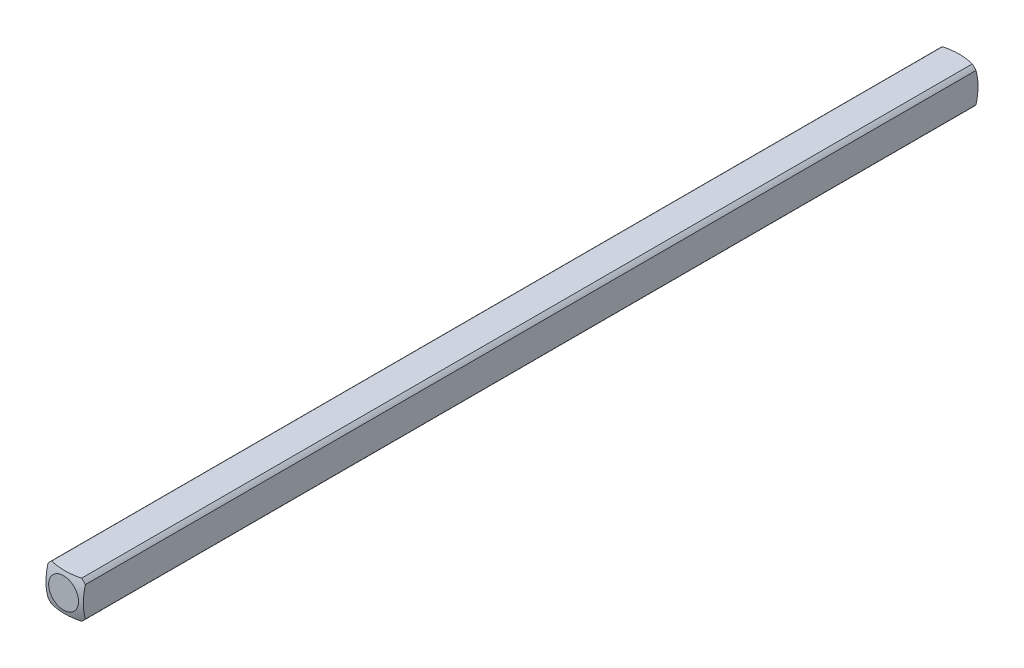
ISO-10303-21;
HEADER;
FILE_DESCRIPTION(('STEP AP214'),'2;1');
FILE_NAME('part.step','',(''),(''),'','','');
FILE_SCHEMA(('AUTOMOTIVE_DESIGN { 1 0 10303 214 1 1 1 1 }'));
ENDSEC;
DATA;
#1=APPLICATION_CONTEXT('core data for automotive mechanical design processes');
#2=APPLICATION_PROTOCOL_DEFINITION('international standard','automotive_design',2000,#1);
#3=PRODUCT_CONTEXT('',#1,'mechanical');
#4=PRODUCT('Part','Part','',(#3));
#5=PRODUCT_RELATED_PRODUCT_CATEGORY('part','',(#4));
#6=PRODUCT_DEFINITION_FORMATION('','',#4);
#7=PRODUCT_DEFINITION_CONTEXT('part definition',#1,'design');
#8=PRODUCT_DEFINITION('design','',#6,#7);
#9=PRODUCT_DEFINITION_SHAPE('','',#8);
#10=(LENGTH_UNIT() NAMED_UNIT(*) SI_UNIT(.MILLI.,.METRE.));
#11=(NAMED_UNIT(*) PLANE_ANGLE_UNIT() SI_UNIT($,.RADIAN.));
#12=(NAMED_UNIT(*) SI_UNIT($,.STERADIAN.) SOLID_ANGLE_UNIT());
#13=UNCERTAINTY_MEASURE_WITH_UNIT(LENGTH_MEASURE(1.E-05),#10,'distance_accuracy_value','');
#14=(GEOMETRIC_REPRESENTATION_CONTEXT(3) GLOBAL_UNCERTAINTY_ASSIGNED_CONTEXT((#13)) GLOBAL_UNIT_ASSIGNED_CONTEXT((#10,
#11,#12)) REPRESENTATION_CONTEXT('',''));
#15=CARTESIAN_POINT('',(0.,0.,0.));
#16=DIRECTION('',(0.,0.,1.));
#17=DIRECTION('',(1.,0.,0.));
#18=AXIS2_PLACEMENT_3D('',#15,#16,#17);
#19=CARTESIAN_POINT('',(-1.5875,-1.5875,38.1));
#20=DIRECTION('',(1.,0.,0.));
#21=DIRECTION('',(0.,0.,-1.));
#22=AXIS2_PLACEMENT_3D('',#19,#20,#21);
#23=PLANE('',#22);
#24=CARTESIAN_POINT('',(-1.5875,0.,4.91912226376204));
#25=DIRECTION('',(1.,0.,0.));
#26=DIRECTION('',(0.,0.,-1.));
#27=AXIS2_PLACEMENT_3D('',#24,#25,#26);
#28=CIRCLE('',#27,4.82558221875869);
#29=CARTESIAN_POINT('',(-1.5875,-1.26841150657032,0.263225357686905));
#30=VERTEX_POINT('',#29);
#31=CARTESIAN_POINT('',(-1.5875,1.26841150657032,0.263225357686935));
#32=VERTEX_POINT('',#31);
#33=EDGE_CURVE('E47',#30,#32,#28,.T.);
#34=ORIENTED_EDGE('',*,*,#33,.F.);
#35=DIRECTION('',(0.,0.,-1.));
#36=VECTOR('',#35,1.);
#37=CARTESIAN_POINT('',(-1.5875,-1.26841150657032,38.1));
#38=LINE('',#37,#36);
#39=CARTESIAN_POINT('',(-1.5875,-1.26841150657032,75.9367746423131));
#40=VERTEX_POINT('',#39);
#41=EDGE_CURVE('E40',#40,#30,#38,.T.);
#42=ORIENTED_EDGE('',*,*,#41,.F.);
#43=CARTESIAN_POINT('',(-1.5875,0.,71.280877736238));
#44=DIRECTION('',(-1.,0.,0.));
#45=DIRECTION('',(0.,0.,1.));
#46=AXIS2_PLACEMENT_3D('',#43,#44,#45);
#47=CIRCLE('',#46,4.82558221875869);
#48=CARTESIAN_POINT('',(-1.5875,1.26841150657032,75.9367746423131));
#49=VERTEX_POINT('',#48);
#50=EDGE_CURVE('E123',#40,#49,#47,.T.);
#51=ORIENTED_EDGE('',*,*,#50,.T.);
#52=DIRECTION('',(0.,0.,-1.));
#53=VECTOR('',#52,1.);
#54=CARTESIAN_POINT('',(-1.5875,1.26841150657032,38.1));
#55=LINE('',#54,#53);
#56=EDGE_CURVE('E111',#32,#49,#55,.F.);
#57=ORIENTED_EDGE('',*,*,#56,.F.);
#58=EDGE_LOOP('',(#34,#42,#51,#57));
#59=FACE_BOUND('',#58,.T.);
#60=ADVANCED_FACE('F33',(#59),#23,.F.);
#61=CARTESIAN_POINT('',(-1.5875,-1.5875,38.1));
#62=DIRECTION('',(0.,1.,0.));
#63=DIRECTION('',(0.,0.,1.));
#64=AXIS2_PLACEMENT_3D('',#61,#62,#63);
#65=PLANE('',#64);
#66=CARTESIAN_POINT('',(0.,-1.5875,4.91912226376204));
#67=DIRECTION('',(0.,1.,0.));
#68=DIRECTION('',(0.,0.,1.));
#69=AXIS2_PLACEMENT_3D('',#66,#67,#68);
#70=CIRCLE('',#69,4.82558221875869);
#71=CARTESIAN_POINT('',(1.26841150657032,-1.5875,0.263225357686905));
#72=VERTEX_POINT('',#71);
#73=CARTESIAN_POINT('',(-1.26841150657032,-1.5875,0.263225357686919));
#74=VERTEX_POINT('',#73);
#75=EDGE_CURVE('E152',#72,#74,#70,.T.);
#76=ORIENTED_EDGE('',*,*,#75,.F.);
#77=DIRECTION('',(0.,0.,-1.));
#78=VECTOR('',#77,1.);
#79=CARTESIAN_POINT('',(1.26841150657032,-1.5875,38.1));
#80=LINE('',#79,#78);
#81=CARTESIAN_POINT('',(1.26841150657032,-1.5875,75.9367746423131));
#82=VERTEX_POINT('',#81);
#83=EDGE_CURVE('E165',#82,#72,#80,.T.);
#84=ORIENTED_EDGE('',*,*,#83,.F.);
#85=CARTESIAN_POINT('',(0.,-1.5875,71.280877736238));
#86=DIRECTION('',(0.,-1.,0.));
#87=DIRECTION('',(0.,0.,-1.));
#88=AXIS2_PLACEMENT_3D('',#85,#86,#87);
#89=CIRCLE('',#88,4.82558221875869);
#90=CARTESIAN_POINT('',(-1.26841150657032,-1.5875,75.9367746423131));
#91=VERTEX_POINT('',#90);
#92=EDGE_CURVE('E134',#82,#91,#89,.T.);
#93=ORIENTED_EDGE('',*,*,#92,.T.);
#94=DIRECTION('',(0.,0.,-1.));
#95=VECTOR('',#94,1.);
#96=CARTESIAN_POINT('',(-1.26841150657032,-1.5875,38.1));
#97=LINE('',#96,#95);
#98=EDGE_CURVE('E163',#74,#91,#97,.F.);
#99=ORIENTED_EDGE('',*,*,#98,.F.);
#100=EDGE_LOOP('',(#76,#84,#93,#99));
#101=FACE_BOUND('',#100,.T.);
#102=ADVANCED_FACE('F175',(#101),#65,.F.);
#103=CARTESIAN_POINT('',(1.5875,-1.5875,38.1));
#104=DIRECTION('',(-1.,0.,0.));
#105=DIRECTION('',(0.,0.,1.));
#106=AXIS2_PLACEMENT_3D('',#103,#104,#105);
#107=PLANE('',#106);
#108=CARTESIAN_POINT('',(1.5875,0.,4.91912226376204));
#109=DIRECTION('',(-1.,0.,0.));
#110=DIRECTION('',(0.,0.,1.));
#111=AXIS2_PLACEMENT_3D('',#108,#109,#110);
#112=CIRCLE('',#111,4.82558221875869);
#113=CARTESIAN_POINT('',(1.5875,1.26841150657032,0.263225357686919));
#114=VERTEX_POINT('',#113);
#115=CARTESIAN_POINT('',(1.5875,-1.26841150657032,0.263225357686905));
#116=VERTEX_POINT('',#115);
#117=EDGE_CURVE('E150',#114,#116,#112,.T.);
#118=ORIENTED_EDGE('',*,*,#117,.F.);
#119=DIRECTION('',(0.,0.,-1.));
#120=VECTOR('',#119,1.);
#121=CARTESIAN_POINT('',(1.5875,1.26841150657032,38.1));
#122=LINE('',#121,#120);
#123=CARTESIAN_POINT('',(1.5875,1.26841150657032,75.9367746423131));
#124=VERTEX_POINT('',#123);
#125=EDGE_CURVE('E160',#124,#114,#122,.T.);
#126=ORIENTED_EDGE('',*,*,#125,.F.);
#127=CARTESIAN_POINT('',(1.5875,0.,71.280877736238));
#128=DIRECTION('',(1.,0.,0.));
#129=DIRECTION('',(0.,0.,-1.));
#130=AXIS2_PLACEMENT_3D('',#127,#128,#129);
#131=CIRCLE('',#130,4.82558221875869);
#132=CARTESIAN_POINT('',(1.5875,-1.26841150657032,75.9367746423131));
#133=VERTEX_POINT('',#132);
#134=EDGE_CURVE('E131',#124,#133,#131,.T.);
#135=ORIENTED_EDGE('',*,*,#134,.T.);
#136=DIRECTION('',(0.,0.,-1.));
#137=VECTOR('',#136,1.);
#138=CARTESIAN_POINT('',(1.5875,-1.26841150657032,38.1));
#139=LINE('',#138,#137);
#140=EDGE_CURVE('E104',#116,#133,#139,.F.);
#141=ORIENTED_EDGE('',*,*,#140,.F.);
#142=EDGE_LOOP('',(#118,#126,#135,#141));
#143=FACE_BOUND('',#142,.T.);
#144=ADVANCED_FACE('F182',(#143),#107,.F.);
#145=CARTESIAN_POINT('',(-1.5875,1.5875,38.1));
#146=DIRECTION('',(0.,-1.,0.));
#147=DIRECTION('',(0.,0.,-1.));
#148=AXIS2_PLACEMENT_3D('',#145,#146,#147);
#149=PLANE('',#148);
#150=CARTESIAN_POINT('',(0.,1.5875,4.91912226376204));
#151=DIRECTION('',(0.,-1.,0.));
#152=DIRECTION('',(0.,0.,-1.));
#153=AXIS2_PLACEMENT_3D('',#150,#151,#152);
#154=CIRCLE('',#153,4.82558221875869);
#155=CARTESIAN_POINT('',(-1.26841150657032,1.5875,0.263225357686919));
#156=VERTEX_POINT('',#155);
#157=CARTESIAN_POINT('',(1.26841150657032,1.5875,0.263225357686905));
#158=VERTEX_POINT('',#157);
#159=EDGE_CURVE('E102',#156,#158,#154,.T.);
#160=ORIENTED_EDGE('',*,*,#159,.F.);
#161=DIRECTION('',(0.,0.,-1.));
#162=VECTOR('',#161,1.);
#163=CARTESIAN_POINT('',(-1.26841150657032,1.5875,38.1));
#164=LINE('',#163,#162);
#165=CARTESIAN_POINT('',(-1.26841150657032,1.5875,75.9367746423131));
#166=VERTEX_POINT('',#165);
#167=EDGE_CURVE('E96',#166,#156,#164,.T.);
#168=ORIENTED_EDGE('',*,*,#167,.F.);
#169=CARTESIAN_POINT('',(0.,1.5875,71.280877736238));
#170=DIRECTION('',(0.,1.,0.));
#171=DIRECTION('',(0.,0.,1.));
#172=AXIS2_PLACEMENT_3D('',#169,#170,#171);
#173=CIRCLE('',#172,4.82558221875869);
#174=CARTESIAN_POINT('',(1.26841150657032,1.5875,75.9367746423131));
#175=VERTEX_POINT('',#174);
#176=EDGE_CURVE('E101',#166,#175,#173,.T.);
#177=ORIENTED_EDGE('',*,*,#176,.T.);
#178=DIRECTION('',(0.,0.,-1.));
#179=VECTOR('',#178,1.);
#180=CARTESIAN_POINT('',(1.26841150657032,1.5875,38.1));
#181=LINE('',#180,#179);
#182=EDGE_CURVE('E105',#158,#175,#181,.F.);
#183=ORIENTED_EDGE('',*,*,#182,.F.);
#184=EDGE_LOOP('',(#160,#168,#177,#183));
#185=FACE_BOUND('',#184,.T.);
#186=ADVANCED_FACE('F98',(#185),#149,.F.);
#187=CARTESIAN_POINT('',(0.,0.,38.1));
#188=DIRECTION('',(0.,0.,-1.));
#189=DIRECTION('',(-1.,0.,0.));
#190=AXIS2_PLACEMENT_3D('',#187,#188,#189);
#191=CYLINDRICAL_SURFACE('',#190,2.032);
#192=ORIENTED_EDGE('',*,*,#41,.T.);
#193=CARTESIAN_POINT('',(0.,0.,0.263225357686919));
#194=DIRECTION('',(0.,0.,1.));
#195=DIRECTION('',(1.,0.,0.));
#196=AXIS2_PLACEMENT_3D('',#193,#194,#195);
#197=CIRCLE('',#196,2.032);
#198=EDGE_CURVE('E147',#30,#74,#197,.T.);
#199=ORIENTED_EDGE('',*,*,#198,.T.);
#200=ORIENTED_EDGE('',*,*,#98,.T.);
#201=CARTESIAN_POINT('',(0.,0.,75.9367746423131));
#202=DIRECTION('',(0.,0.,1.));
#203=DIRECTION('',(1.,0.,0.));
#204=AXIS2_PLACEMENT_3D('',#201,#202,#203);
#205=CIRCLE('',#204,2.032);
#206=EDGE_CURVE('E128',#40,#91,#205,.T.);
#207=ORIENTED_EDGE('',*,*,#206,.F.);
#208=EDGE_LOOP('',(#192,#199,#200,#207));
#209=FACE_BOUND('',#208,.T.);
#210=ADVANCED_FACE('F171',(#209),#191,.T.);
#211=ORIENTED_EDGE('',*,*,#83,.T.);
#212=CARTESIAN_POINT('',(0.,0.,0.263225357686919));
#213=DIRECTION('',(0.,0.,1.));
#214=DIRECTION('',(1.,0.,0.));
#215=AXIS2_PLACEMENT_3D('',#212,#213,#214);
#216=CIRCLE('',#215,2.032);
#217=EDGE_CURVE('E53',#72,#116,#216,.T.);
#218=ORIENTED_EDGE('',*,*,#217,.T.);
#219=ORIENTED_EDGE('',*,*,#140,.T.);
#220=CARTESIAN_POINT('',(0.,0.,75.9367746423131));
#221=DIRECTION('',(0.,0.,1.));
#222=DIRECTION('',(1.,0.,0.));
#223=AXIS2_PLACEMENT_3D('',#220,#221,#222);
#224=CIRCLE('',#223,2.032);
#225=EDGE_CURVE('E137',#82,#133,#224,.T.);
#226=ORIENTED_EDGE('',*,*,#225,.F.);
#227=EDGE_LOOP('',(#211,#218,#219,#226));
#228=FACE_BOUND('',#227,.T.);
#229=ADVANCED_FACE('F178',(#228),#191,.T.);
#230=ORIENTED_EDGE('',*,*,#125,.T.);
#231=CARTESIAN_POINT('',(0.,0.,0.263225357686919));
#232=DIRECTION('',(0.,0.,1.));
#233=DIRECTION('',(1.,0.,0.));
#234=AXIS2_PLACEMENT_3D('',#231,#232,#233);
#235=CIRCLE('',#234,2.032);
#236=EDGE_CURVE('E144',#114,#158,#235,.T.);
#237=ORIENTED_EDGE('',*,*,#236,.T.);
#238=ORIENTED_EDGE('',*,*,#182,.T.);
#239=CARTESIAN_POINT('',(0.,0.,75.9367746423131));
#240=DIRECTION('',(0.,0.,1.));
#241=DIRECTION('',(1.,0.,0.));
#242=AXIS2_PLACEMENT_3D('',#239,#240,#241);
#243=CIRCLE('',#242,2.032);
#244=EDGE_CURVE('E122',#124,#175,#243,.T.);
#245=ORIENTED_EDGE('',*,*,#244,.F.);
#246=EDGE_LOOP('',(#230,#237,#238,#245));
#247=FACE_BOUND('',#246,.T.);
#248=ADVANCED_FACE('F184',(#247),#191,.T.);
#249=ORIENTED_EDGE('',*,*,#167,.T.);
#250=CARTESIAN_POINT('',(0.,0.,0.263225357686919));
#251=DIRECTION('',(0.,0.,1.));
#252=DIRECTION('',(1.,0.,0.));
#253=AXIS2_PLACEMENT_3D('',#250,#251,#252);
#254=CIRCLE('',#253,2.032);
#255=EDGE_CURVE('E12',#156,#32,#254,.T.);
#256=ORIENTED_EDGE('',*,*,#255,.T.);
#257=ORIENTED_EDGE('',*,*,#56,.T.);
#258=CARTESIAN_POINT('',(0.,0.,75.9367746423131));
#259=DIRECTION('',(0.,0.,1.));
#260=DIRECTION('',(1.,0.,0.));
#261=AXIS2_PLACEMENT_3D('',#258,#259,#260);
#262=CIRCLE('',#261,2.032);
#263=EDGE_CURVE('E108',#166,#49,#262,.T.);
#264=ORIENTED_EDGE('',*,*,#263,.F.);
#265=EDGE_LOOP('',(#249,#256,#257,#264));
#266=FACE_BOUND('',#265,.T.);
#267=ADVANCED_FACE('F109',(#266),#191,.T.);
#268=CARTESIAN_POINT('',(0.,0.,4.91912226376204));
#269=DIRECTION('',(0.,0.,1.));
#270=DIRECTION('',(-1.,0.,0.));
#271=AXIS2_PLACEMENT_3D('',#268,#269,#270);
#272=SPHERICAL_SURFACE('',#271,5.08);
#273=CARTESIAN_POINT('',(0.,0.,0.));
#274=DIRECTION('',(0.,0.,-1.));
#275=DIRECTION('',(-1.,0.,0.));
#276=AXIS2_PLACEMENT_3D('',#273,#274,#275);
#277=CIRCLE('',#276,1.26832020963187);
#278=CARTESIAN_POINT('',(-1.26832020963187,0.,0.));
#279=VERTEX_POINT('',#278);
#280=EDGE_CURVE('E155',#279,#279,#277,.T.);
#281=ORIENTED_EDGE('',*,*,#280,.F.);
#282=EDGE_LOOP('',(#281));
#283=FACE_BOUND('',#282,.T.);
#284=ORIENTED_EDGE('',*,*,#75,.T.);
#285=ORIENTED_EDGE('',*,*,#198,.F.);
#286=ORIENTED_EDGE('',*,*,#33,.T.);
#287=ORIENTED_EDGE('',*,*,#255,.F.);
#288=ORIENTED_EDGE('',*,*,#159,.T.);
#289=ORIENTED_EDGE('',*,*,#236,.F.);
#290=ORIENTED_EDGE('',*,*,#117,.T.);
#291=ORIENTED_EDGE('',*,*,#217,.F.);
#292=EDGE_LOOP('',(#284,#285,#286,#287,#288,#289,#290,#291));
#293=FACE_BOUND('',#292,.T.);
#294=ADVANCED_FACE('F185',(#283,#293),#272,.T.);
#295=CARTESIAN_POINT('',(0.,0.,0.));
#296=DIRECTION('',(0.,0.,-1.));
#297=DIRECTION('',(-1.,0.,0.));
#298=AXIS2_PLACEMENT_3D('',#295,#296,#297);
#299=PLANE('',#298);
#300=ORIENTED_EDGE('',*,*,#280,.T.);
#301=EDGE_LOOP('',(#300));
#302=FACE_BOUND('',#301,.T.);
#303=ADVANCED_FACE('F187',(#302),#299,.T.);
#304=CARTESIAN_POINT('',(0.,0.,71.280877736238));
#305=DIRECTION('',(0.,0.,-1.));
#306=DIRECTION('',(-1.,0.,0.));
#307=AXIS2_PLACEMENT_3D('',#304,#305,#306);
#308=SPHERICAL_SURFACE('',#307,5.08);
#309=CARTESIAN_POINT('',(0.,0.,76.2));
#310=DIRECTION('',(0.,0.,-1.));
#311=DIRECTION('',(-1.,0.,0.));
#312=AXIS2_PLACEMENT_3D('',#309,#310,#311);
#313=CIRCLE('',#312,1.26832020963187);
#314=CARTESIAN_POINT('',(-1.26832020963187,0.,76.2));
#315=VERTEX_POINT('',#314);
#316=EDGE_CURVE('E115',#315,#315,#313,.T.);
#317=ORIENTED_EDGE('',*,*,#316,.T.);
#318=EDGE_LOOP('',(#317));
#319=FACE_BOUND('',#318,.T.);
#320=ORIENTED_EDGE('',*,*,#92,.F.);
#321=ORIENTED_EDGE('',*,*,#225,.T.);
#322=ORIENTED_EDGE('',*,*,#134,.F.);
#323=ORIENTED_EDGE('',*,*,#244,.T.);
#324=ORIENTED_EDGE('',*,*,#176,.F.);
#325=ORIENTED_EDGE('',*,*,#263,.T.);
#326=ORIENTED_EDGE('',*,*,#50,.F.);
#327=ORIENTED_EDGE('',*,*,#206,.T.);
#328=EDGE_LOOP('',(#320,#321,#322,#323,#324,#325,#326,#327));
#329=FACE_BOUND('',#328,.T.);
#330=ADVANCED_FACE('F119',(#319,#329),#308,.T.);
#331=CARTESIAN_POINT('',(0.,0.,76.2));
#332=DIRECTION('',(0.,0.,1.));
#333=DIRECTION('',(-1.,0.,0.));
#334=AXIS2_PLACEMENT_3D('',#331,#332,#333);
#335=PLANE('',#334);
#336=ORIENTED_EDGE('',*,*,#316,.F.);
#337=EDGE_LOOP('',(#336));
#338=FACE_BOUND('',#337,.T.);
#339=ADVANCED_FACE('F232',(#338),#335,.T.);
#340=CLOSED_SHELL('',(#60,#102,#144,#186,#210,#229,#248,#267,#294,#303,#330,#339));
#341=MANIFOLD_SOLID_BREP('B2',#340);
#342=ADVANCED_BREP_SHAPE_REPRESENTATION('',(#18,#341),#14);
#343=SHAPE_DEFINITION_REPRESENTATION(#9,#342);
ENDSEC;
END-ISO-10303-21;
